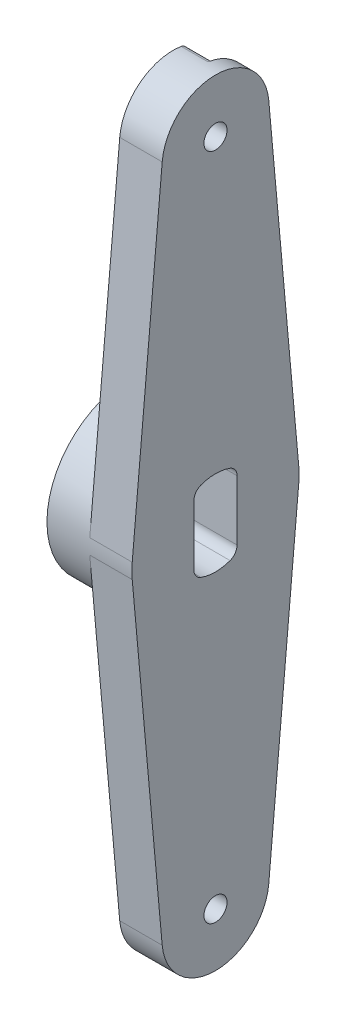
ISO-10303-21;
HEADER;
FILE_DESCRIPTION(('STEP AP214'),'2;1');
FILE_NAME('part.step','',(''),(''),'','','');
FILE_SCHEMA(('AUTOMOTIVE_DESIGN { 1 0 10303 214 1 1 1 1 }'));
ENDSEC;
DATA;
#1=APPLICATION_CONTEXT('core data for automotive mechanical design processes');
#2=APPLICATION_PROTOCOL_DEFINITION('international standard','automotive_design',2000,#1);
#3=PRODUCT_CONTEXT('',#1,'mechanical');
#4=PRODUCT('Part','Part','',(#3));
#5=PRODUCT_RELATED_PRODUCT_CATEGORY('part','',(#4));
#6=PRODUCT_DEFINITION_FORMATION('','',#4);
#7=PRODUCT_DEFINITION_CONTEXT('part definition',#1,'design');
#8=PRODUCT_DEFINITION('design','',#6,#7);
#9=PRODUCT_DEFINITION_SHAPE('','',#8);
#10=(LENGTH_UNIT() NAMED_UNIT(*) SI_UNIT(.MILLI.,.METRE.));
#11=(NAMED_UNIT(*) PLANE_ANGLE_UNIT() SI_UNIT($,.RADIAN.));
#12=(NAMED_UNIT(*) SI_UNIT($,.STERADIAN.) SOLID_ANGLE_UNIT());
#13=UNCERTAINTY_MEASURE_WITH_UNIT(LENGTH_MEASURE(1.E-05),#10,'distance_accuracy_value','');
#14=(GEOMETRIC_REPRESENTATION_CONTEXT(3) GLOBAL_UNCERTAINTY_ASSIGNED_CONTEXT((#13)) GLOBAL_UNIT_ASSIGNED_CONTEXT((#10,
#11,#12)) REPRESENTATION_CONTEXT('',''));
#15=CARTESIAN_POINT('',(0.,0.,0.));
#16=DIRECTION('',(0.,0.,1.));
#17=DIRECTION('',(1.,0.,0.));
#18=AXIS2_PLACEMENT_3D('',#15,#16,#17);
#19=CARTESIAN_POINT('',(-2.35,-50.,0.));
#20=DIRECTION('',(-1.,0.,0.));
#21=DIRECTION('',(0.,0.,1.));
#22=AXIS2_PLACEMENT_3D('',#19,#20,#21);
#23=CYLINDRICAL_SURFACE('',#22,3.5);
#24=CARTESIAN_POINT('',(-2.35,-50.,0.));
#25=DIRECTION('',(1.,0.,0.));
#26=DIRECTION('',(0.,0.,1.));
#27=AXIS2_PLACEMENT_3D('',#24,#25,#26);
#28=CIRCLE('',#27,3.5);
#29=CARTESIAN_POINT('',(-2.35,-50.,3.5));
#30=VERTEX_POINT('',#29);
#31=EDGE_CURVE('E361',#30,#30,#28,.T.);
#32=ORIENTED_EDGE('',*,*,#31,.F.);
#33=EDGE_LOOP('',(#32));
#34=FACE_BOUND('',#33,.T.);
#35=CARTESIAN_POINT('',(-4.15,-50.,0.));
#36=DIRECTION('',(1.,0.,0.));
#37=DIRECTION('',(0.,0.,1.));
#38=AXIS2_PLACEMENT_3D('',#35,#36,#37);
#39=CIRCLE('',#38,3.5);
#40=CARTESIAN_POINT('',(-4.15,-50.,3.5));
#41=VERTEX_POINT('',#40);
#42=EDGE_CURVE('E332',#41,#41,#39,.T.);
#43=ORIENTED_EDGE('',*,*,#42,.T.);
#44=EDGE_LOOP('',(#43));
#45=FACE_BOUND('',#44,.T.);
#46=ADVANCED_FACE('F34',(#34,#45),#23,.T.);
#47=CARTESIAN_POINT('',(-2.35,50.,0.));
#48=DIRECTION('',(-1.,0.,0.));
#49=DIRECTION('',(0.,0.,1.));
#50=AXIS2_PLACEMENT_3D('',#47,#48,#49);
#51=CYLINDRICAL_SURFACE('',#50,3.5);
#52=CARTESIAN_POINT('',(-2.35,50.,0.));
#53=DIRECTION('',(-1.,0.,0.));
#54=DIRECTION('',(0.,0.,1.));
#55=AXIS2_PLACEMENT_3D('',#52,#53,#54);
#56=CIRCLE('',#55,3.5);
#57=CARTESIAN_POINT('',(-2.35,50.,3.5));
#58=VERTEX_POINT('',#57);
#59=EDGE_CURVE('E521',#58,#58,#56,.T.);
#60=ORIENTED_EDGE('',*,*,#59,.T.);
#61=EDGE_LOOP('',(#60));
#62=FACE_BOUND('',#61,.T.);
#63=CARTESIAN_POINT('',(-4.15,50.,0.));
#64=DIRECTION('',(-1.,0.,0.));
#65=DIRECTION('',(0.,0.,1.));
#66=AXIS2_PLACEMENT_3D('',#63,#64,#65);
#67=CIRCLE('',#66,3.5);
#68=CARTESIAN_POINT('',(-4.15,50.,3.5));
#69=VERTEX_POINT('',#68);
#70=EDGE_CURVE('E336',#69,#69,#67,.T.);
#71=ORIENTED_EDGE('',*,*,#70,.F.);
#72=EDGE_LOOP('',(#71));
#73=FACE_BOUND('',#72,.T.);
#74=ADVANCED_FACE('F552',(#62,#73),#51,.T.);
#75=CARTESIAN_POINT('',(-6.35,0.,0.));
#76=DIRECTION('',(1.,0.,0.));
#77=DIRECTION('',(0.,0.,-1.));
#78=AXIS2_PLACEMENT_3D('',#75,#76,#77);
#79=PLANE('',#78);
#80=CARTESIAN_POINT('',(-6.35,0.,0.));
#81=DIRECTION('',(-1.,0.,0.));
#82=DIRECTION('',(0.,0.,1.));
#83=AXIS2_PLACEMENT_3D('',#80,#81,#82);
#84=CIRCLE('',#83,12.5);
#85=CARTESIAN_POINT('',(-6.35,1.125,12.4492720670728));
#86=VERTEX_POINT('',#85);
#87=CARTESIAN_POINT('',(-6.35,1.125,-12.4492720670728));
#88=VERTEX_POINT('',#87);
#89=EDGE_CURVE('E221',#86,#88,#84,.T.);
#90=ORIENTED_EDGE('',*,*,#89,.F.);
#91=DIRECTION('',(0.,-0.995941765365827,0.09));
#92=VECTOR('',#91,1.);
#93=CARTESIAN_POINT('',(-6.35,1.125,12.4492720670728));
#94=LINE('',#93,#92);
#95=CARTESIAN_POINT('',(-6.35,50.72,7.96753412292662));
#96=VERTEX_POINT('',#95);
#97=EDGE_CURVE('E226',#96,#86,#94,.T.);
#98=ORIENTED_EDGE('',*,*,#97,.F.);
#99=CARTESIAN_POINT('',(-6.35,50.,0.));
#100=DIRECTION('',(1.,0.,0.));
#101=DIRECTION('',(0.,0.,-1.));
#102=AXIS2_PLACEMENT_3D('',#99,#100,#101);
#103=CIRCLE('',#102,8.);
#104=CARTESIAN_POINT('',(-6.35,57.9065625554529,-1.21912614470803));
#105=VERTEX_POINT('',#104);
#106=EDGE_CURVE('E249',#105,#96,#103,.T.);
#107=ORIENTED_EDGE('',*,*,#106,.F.);
#108=CARTESIAN_POINT('',(-6.35,56.9182422360213,-1.06673537661953));
#109=DIRECTION('',(1.,0.,0.));
#110=DIRECTION('',(0.,0.,-1.));
#111=AXIS2_PLACEMENT_3D('',#108,#109,#110);
#112=CIRCLE('',#111,1.);
#113=CARTESIAN_POINT('',(-6.35,55.9671857197261,-1.37575237099447));
#114=VERTEX_POINT('',#113);
#115=EDGE_CURVE('E391',#105,#114,#112,.F.);
#116=ORIENTED_EDGE('',*,*,#115,.T.);
#117=DIRECTION('',(0.,0.309016994374941,-0.951056516295156));
#118=VECTOR('',#117,1.);
#119=CARTESIAN_POINT('',(-6.35,56.8583808987666,-4.11856910193741));
#120=LINE('',#119,#118);
#121=CARTESIAN_POINT('',(-6.35,54.9930467105496,1.62233922046844));
#122=VERTEX_POINT('',#121);
#123=EDGE_CURVE('E425',#122,#114,#120,.T.);
#124=ORIENTED_EDGE('',*,*,#123,.F.);
#125=CARTESIAN_POINT('',(-6.35,50.,0.));
#126=DIRECTION('',(-1.,0.,0.));
#127=DIRECTION('',(0.,0.,1.));
#128=AXIS2_PLACEMENT_3D('',#125,#126,#127);
#129=CIRCLE('',#128,5.25);
#130=CARTESIAN_POINT('',(-6.35,45.0069532894504,1.62233922046844));
#131=VERTEX_POINT('',#130);
#132=EDGE_CURVE('E430',#131,#122,#129,.T.);
#133=ORIENTED_EDGE('',*,*,#132,.F.);
#134=DIRECTION('',(0.,0.309016994374941,0.951056516295156));
#135=VECTOR('',#134,1.);
#136=CARTESIAN_POINT('',(-6.35,41.6239365758729,-8.789515624898));
#137=LINE('',#136,#135);
#138=CARTESIAN_POINT('',(-6.35,41.8278365801193,-8.16197593859896));
#139=VERTEX_POINT('',#138);
#140=EDGE_CURVE('E434',#139,#131,#137,.T.);
#141=ORIENTED_EDGE('',*,*,#140,.F.);
#142=CARTESIAN_POINT('',(-6.35,40.8767800638241,-7.85295894422402));
#143=DIRECTION('',(1.,0.,0.));
#144=DIRECTION('',(0.,0.,-1.));
#145=AXIS2_PLACEMENT_3D('',#142,#143,#144);
#146=CIRCLE('',#145,1.);
#147=CARTESIAN_POINT('',(-6.35,40.9667800638241,-8.84890070958985));
#148=VERTEX_POINT('',#147);
#149=EDGE_CURVE('E393',#139,#148,#146,.F.);
#150=ORIENTED_EDGE('',*,*,#149,.T.);
#151=DIRECTION('',(0.,0.995941765365827,0.09));
#152=VECTOR('',#151,1.);
#153=CARTESIAN_POINT('',(-6.35,1.125,-12.4492720670728));
#154=LINE('',#153,#152);
#155=EDGE_CURVE('E228',#88,#148,#154,.T.);
#156=ORIENTED_EDGE('',*,*,#155,.F.);
#157=EDGE_LOOP('',(#90,#98,#107,#116,#124,#133,#141,#150,#156));
#158=FACE_BOUND('',#157,.T.);
#159=ADVANCED_FACE('F223',(#158),#79,.F.);
#160=DIRECTION('',(0.,0.995941765365827,-0.09));
#161=VECTOR('',#160,1.);
#162=CARTESIAN_POINT('',(-6.35,-1.125,-12.4492720670728));
#163=LINE('',#162,#161);
#164=CARTESIAN_POINT('',(-6.35,-40.9667800638241,-8.84890070958985));
#165=VERTEX_POINT('',#164);
#166=CARTESIAN_POINT('',(-6.35,-1.125,-12.4492720670728));
#167=VERTEX_POINT('',#166);
#168=EDGE_CURVE('E263',#165,#167,#163,.T.);
#169=ORIENTED_EDGE('',*,*,#168,.F.);
#170=CARTESIAN_POINT('',(-6.35,-40.8767800638241,-7.85295894422402));
#171=DIRECTION('',(1.,0.,0.));
#172=DIRECTION('',(0.,0.,-1.));
#173=AXIS2_PLACEMENT_3D('',#170,#171,#172);
#174=CIRCLE('',#173,1.);
#175=CARTESIAN_POINT('',(-6.35,-41.8278365801193,-8.16197593859896));
#176=VERTEX_POINT('',#175);
#177=EDGE_CURVE('E284',#165,#176,#174,.F.);
#178=ORIENTED_EDGE('',*,*,#177,.T.);
#179=DIRECTION('',(0.,-0.309016994374941,0.951056516295156));
#180=VECTOR('',#179,1.);
#181=CARTESIAN_POINT('',(-6.35,-41.6239365758729,-8.789515624898));
#182=LINE('',#181,#180);
#183=CARTESIAN_POINT('',(-6.35,-45.0069532894504,1.62233922046844));
#184=VERTEX_POINT('',#183);
#185=EDGE_CURVE('E507',#176,#184,#182,.T.);
#186=ORIENTED_EDGE('',*,*,#185,.T.);
#187=CARTESIAN_POINT('',(-6.35,-50.,0.));
#188=DIRECTION('',(1.,0.,0.));
#189=DIRECTION('',(0.,0.,1.));
#190=AXIS2_PLACEMENT_3D('',#187,#188,#189);
#191=CIRCLE('',#190,5.25);
#192=CARTESIAN_POINT('',(-6.35,-54.9930467105496,1.62233922046844));
#193=VERTEX_POINT('',#192);
#194=EDGE_CURVE('E514',#184,#193,#191,.T.);
#195=ORIENTED_EDGE('',*,*,#194,.T.);
#196=DIRECTION('',(0.,-0.309016994374941,-0.951056516295156));
#197=VECTOR('',#196,1.);
#198=CARTESIAN_POINT('',(-6.35,-56.8583808987666,-4.11856910193741));
#199=LINE('',#198,#197);
#200=CARTESIAN_POINT('',(-6.35,-55.9671857197261,-1.37575237099447));
#201=VERTEX_POINT('',#200);
#202=EDGE_CURVE('E512',#193,#201,#199,.T.);
#203=ORIENTED_EDGE('',*,*,#202,.T.);
#204=CARTESIAN_POINT('',(-6.35,-56.9182422360213,-1.06673537661953));
#205=DIRECTION('',(1.,0.,0.));
#206=DIRECTION('',(0.,0.,-1.));
#207=AXIS2_PLACEMENT_3D('',#204,#205,#206);
#208=CIRCLE('',#207,1.);
#209=CARTESIAN_POINT('',(-6.35,-57.9065625554529,-1.21912614470803));
#210=VERTEX_POINT('',#209);
#211=EDGE_CURVE('E281',#201,#210,#208,.F.);
#212=ORIENTED_EDGE('',*,*,#211,.T.);
#213=CARTESIAN_POINT('',(-6.35,-50.,0.));
#214=DIRECTION('',(1.,0.,0.));
#215=DIRECTION('',(0.,0.,-1.));
#216=AXIS2_PLACEMENT_3D('',#213,#214,#215);
#217=CIRCLE('',#216,8.);
#218=CARTESIAN_POINT('',(-6.35,-50.72,7.96753412292662));
#219=VERTEX_POINT('',#218);
#220=EDGE_CURVE('E252',#219,#210,#217,.T.);
#221=ORIENTED_EDGE('',*,*,#220,.F.);
#222=DIRECTION('',(0.,-0.995941765365827,-0.09));
#223=VECTOR('',#222,1.);
#224=CARTESIAN_POINT('',(-6.35,-1.125,12.4492720670728));
#225=LINE('',#224,#223);
#226=CARTESIAN_POINT('',(-6.35,-1.125,12.4492720670728));
#227=VERTEX_POINT('',#226);
#228=EDGE_CURVE('E248',#227,#219,#225,.T.);
#229=ORIENTED_EDGE('',*,*,#228,.F.);
#230=EDGE_CURVE('E282',#167,#227,#84,.T.);
#231=ORIENTED_EDGE('',*,*,#230,.F.);
#232=EDGE_LOOP('',(#169,#178,#186,#195,#203,#212,#221,#229,#231));
#233=FACE_BOUND('',#232,.T.);
#234=ADVANCED_FACE('F480',(#233),#79,.F.);
#235=CARTESIAN_POINT('',(-6.35,-1.125,-12.4492720670728));
#236=DIRECTION('',(0.,-0.09,-0.995941765365827));
#237=DIRECTION('',(0.,0.995941765365827,-0.09));
#238=AXIS2_PLACEMENT_3D('',#235,#236,#237);
#239=PLANE('',#238);
#240=DIRECTION('',(0.,0.995941765365827,-0.0899999999999998));
#241=VECTOR('',#240,1.);
#242=CARTESIAN_POINT('',(-2.35,-41.6239365758729,-8.789515624898));
#243=LINE('',#242,#241);
#244=CARTESIAN_POINT('',(-2.35,-50.72,-7.96753412292662));
#245=VERTEX_POINT('',#244);
#246=CARTESIAN_POINT('',(-2.35,-40.9667800638241,-8.84890070958984));
#247=VERTEX_POINT('',#246);
#248=EDGE_CURVE('E510',#245,#247,#243,.T.);
#249=ORIENTED_EDGE('',*,*,#248,.T.);
#250=DIRECTION('',(-1.,0.,0.));
#251=VECTOR('',#250,1.);
#252=CARTESIAN_POINT('',(-6.35,-40.9667800638241,-8.84890070958985));
#253=LINE('',#252,#251);
#254=EDGE_CURVE('E278',#247,#165,#253,.T.);
#255=ORIENTED_EDGE('',*,*,#254,.T.);
#256=ORIENTED_EDGE('',*,*,#168,.T.);
#257=DIRECTION('',(1.,0.,0.));
#258=VECTOR('',#257,1.);
#259=CARTESIAN_POINT('',(-6.35,-1.125,-12.4492720670728));
#260=LINE('',#259,#258);
#261=CARTESIAN_POINT('',(0.,-1.125,-12.4492720670728));
#262=VERTEX_POINT('',#261);
#263=EDGE_CURVE('E272',#167,#262,#260,.T.);
#264=ORIENTED_EDGE('',*,*,#263,.T.);
#265=DIRECTION('',(0.,0.995941765365827,-0.09));
#266=VECTOR('',#265,1.);
#267=CARTESIAN_POINT('',(0.,-1.125,-12.4492720670728));
#268=LINE('',#267,#266);
#269=CARTESIAN_POINT('',(0.,-50.72,-7.96753412292662));
#270=VERTEX_POINT('',#269);
#271=EDGE_CURVE('E267',#270,#262,#268,.T.);
#272=ORIENTED_EDGE('',*,*,#271,.F.);
#273=DIRECTION('',(1.,0.,0.));
#274=VECTOR('',#273,1.);
#275=CARTESIAN_POINT('',(-6.35,-50.72,-7.96753412292662));
#276=LINE('',#275,#274);
#277=EDGE_CURVE('E379',#245,#270,#276,.T.);
#278=ORIENTED_EDGE('',*,*,#277,.F.);
#279=EDGE_LOOP('',(#249,#255,#256,#264,#272,#278));
#280=FACE_BOUND('',#279,.T.);
#281=ADVANCED_FACE('F468',(#280),#239,.T.);
#282=CARTESIAN_POINT('',(-6.35,-50.,0.));
#283=DIRECTION('',(1.,0.,0.));
#284=DIRECTION('',(0.,0.,-1.));
#285=AXIS2_PLACEMENT_3D('',#282,#283,#284);
#286=CYLINDRICAL_SURFACE('',#285,8.);
#287=ORIENTED_EDGE('',*,*,#220,.T.);
#288=DIRECTION('',(1.,0.,0.));
#289=VECTOR('',#288,1.);
#290=CARTESIAN_POINT('',(-6.35,-57.9065625554529,-1.21912614470803));
#291=LINE('',#290,#289);
#292=CARTESIAN_POINT('',(-2.35,-57.9065625554529,-1.21912614470803));
#293=VERTEX_POINT('',#292);
#294=EDGE_CURVE('E291',#210,#293,#291,.T.);
#295=ORIENTED_EDGE('',*,*,#294,.T.);
#296=CARTESIAN_POINT('',(-2.35,-50.,0.));
#297=DIRECTION('',(1.,0.,0.));
#298=DIRECTION('',(0.,0.,1.));
#299=AXIS2_PLACEMENT_3D('',#296,#297,#298);
#300=CIRCLE('',#299,8.);
#301=EDGE_CURVE('E497',#293,#245,#300,.T.);
#302=ORIENTED_EDGE('',*,*,#301,.T.);
#303=ORIENTED_EDGE('',*,*,#277,.T.);
#304=CARTESIAN_POINT('',(0.,-50.,0.));
#305=DIRECTION('',(1.,0.,0.));
#306=DIRECTION('',(0.,0.,-1.));
#307=AXIS2_PLACEMENT_3D('',#304,#305,#306);
#308=CIRCLE('',#307,8.);
#309=CARTESIAN_POINT('',(0.,-50.72,7.96753412292662));
#310=VERTEX_POINT('',#309);
#311=EDGE_CURVE('E459',#310,#270,#308,.T.);
#312=ORIENTED_EDGE('',*,*,#311,.F.);
#313=DIRECTION('',(1.,0.,0.));
#314=VECTOR('',#313,1.);
#315=CARTESIAN_POINT('',(-6.35,-50.72,7.96753412292662));
#316=LINE('',#315,#314);
#317=EDGE_CURVE('E373',#219,#310,#316,.T.);
#318=ORIENTED_EDGE('',*,*,#317,.F.);
#319=EDGE_LOOP('',(#287,#295,#302,#303,#312,#318));
#320=FACE_BOUND('',#319,.T.);
#321=ADVANCED_FACE('F484',(#320),#286,.T.);
#322=CARTESIAN_POINT('',(-6.35,-1.125,12.4492720670728));
#323=DIRECTION('',(0.,-0.09,0.995941765365827));
#324=DIRECTION('',(0.,-0.995941765365827,-0.09));
#325=AXIS2_PLACEMENT_3D('',#322,#323,#324);
#326=PLANE('',#325);
#327=DIRECTION('',(0.,-0.995941765365827,-0.09));
#328=VECTOR('',#327,1.);
#329=CARTESIAN_POINT('',(0.,-1.125,12.4492720670728));
#330=LINE('',#329,#328);
#331=CARTESIAN_POINT('',(0.,-1.125,12.4492720670728));
#332=VERTEX_POINT('',#331);
#333=EDGE_CURVE('E456',#332,#310,#330,.T.);
#334=ORIENTED_EDGE('',*,*,#333,.F.);
#335=DIRECTION('',(1.,0.,0.));
#336=VECTOR('',#335,1.);
#337=CARTESIAN_POINT('',(-6.35,-1.125,12.4492720670728));
#338=LINE('',#337,#336);
#339=EDGE_CURVE('E243',#227,#332,#338,.T.);
#340=ORIENTED_EDGE('',*,*,#339,.F.);
#341=ORIENTED_EDGE('',*,*,#228,.T.);
#342=ORIENTED_EDGE('',*,*,#317,.T.);
#343=EDGE_LOOP('',(#334,#340,#341,#342));
#344=FACE_BOUND('',#343,.T.);
#345=ADVANCED_FACE('F476',(#344),#326,.T.);
#346=CARTESIAN_POINT('',(-6.35,0.,0.));
#347=DIRECTION('',(1.,0.,0.));
#348=DIRECTION('',(0.,0.,-1.));
#349=AXIS2_PLACEMENT_3D('',#346,#347,#348);
#350=CYLINDRICAL_SURFACE('',#349,12.5);
#351=CARTESIAN_POINT('',(0.,0.,0.));
#352=DIRECTION('',(1.,0.,0.));
#353=DIRECTION('',(0.,0.,-1.));
#354=AXIS2_PLACEMENT_3D('',#351,#352,#353);
#355=CIRCLE('',#354,12.5);
#356=CARTESIAN_POINT('',(0.,1.125,12.4492720670728));
#357=VERTEX_POINT('',#356);
#358=EDGE_CURVE('E239',#357,#332,#355,.T.);
#359=ORIENTED_EDGE('',*,*,#358,.F.);
#360=DIRECTION('',(1.,0.,0.));
#361=VECTOR('',#360,1.);
#362=CARTESIAN_POINT('',(-6.35,1.125,12.4492720670728));
#363=LINE('',#362,#361);
#364=EDGE_CURVE('E235',#86,#357,#363,.T.);
#365=ORIENTED_EDGE('',*,*,#364,.F.);
#366=ORIENTED_EDGE('',*,*,#89,.T.);
#367=DIRECTION('',(1.,0.,0.));
#368=VECTOR('',#367,1.);
#369=CARTESIAN_POINT('',(-6.35,1.125,-12.4492720670728));
#370=LINE('',#369,#368);
#371=CARTESIAN_POINT('',(0.,1.125,-12.4492720670728));
#372=VERTEX_POINT('',#371);
#373=EDGE_CURVE('E260',#88,#372,#370,.T.);
#374=ORIENTED_EDGE('',*,*,#373,.T.);
#375=CARTESIAN_POINT('',(0.,0.,0.));
#376=DIRECTION('',(1.,0.,0.));
#377=DIRECTION('',(0.,0.,-1.));
#378=AXIS2_PLACEMENT_3D('',#375,#376,#377);
#379=CIRCLE('',#378,12.5);
#380=EDGE_CURVE('E439',#262,#372,#379,.T.);
#381=ORIENTED_EDGE('',*,*,#380,.F.);
#382=ORIENTED_EDGE('',*,*,#263,.F.);
#383=ORIENTED_EDGE('',*,*,#230,.T.);
#384=ORIENTED_EDGE('',*,*,#339,.T.);
#385=EDGE_LOOP('',(#359,#365,#366,#374,#381,#382,#383,#384));
#386=FACE_BOUND('',#385,.T.);
#387=CARTESIAN_POINT('',(-12.7,0.,0.));
#388=DIRECTION('',(-1.,0.,0.));
#389=DIRECTION('',(0.,0.,1.));
#390=AXIS2_PLACEMENT_3D('',#387,#388,#389);
#391=CIRCLE('',#390,12.5);
#392=CARTESIAN_POINT('',(-12.7,0.,12.5));
#393=VERTEX_POINT('',#392);
#394=EDGE_CURVE('E231',#393,#393,#391,.T.);
#395=ORIENTED_EDGE('',*,*,#394,.F.);
#396=EDGE_LOOP('',(#395));
#397=FACE_BOUND('',#396,.T.);
#398=ADVANCED_FACE('F236',(#386,#397),#350,.T.);
#399=CARTESIAN_POINT('',(-6.35,1.125,12.4492720670728));
#400=DIRECTION('',(0.,0.09,0.995941765365827));
#401=DIRECTION('',(0.,-0.995941765365827,0.09));
#402=AXIS2_PLACEMENT_3D('',#399,#400,#401);
#403=PLANE('',#402);
#404=DIRECTION('',(0.,-0.995941765365827,0.09));
#405=VECTOR('',#404,1.);
#406=CARTESIAN_POINT('',(0.,1.125,12.4492720670728));
#407=LINE('',#406,#405);
#408=CARTESIAN_POINT('',(0.,50.72,7.96753412292662));
#409=VERTEX_POINT('',#408);
#410=EDGE_CURVE('E453',#409,#357,#407,.T.);
#411=ORIENTED_EDGE('',*,*,#410,.F.);
#412=DIRECTION('',(1.,0.,0.));
#413=VECTOR('',#412,1.);
#414=CARTESIAN_POINT('',(-6.35,50.72,7.96753412292662));
#415=LINE('',#414,#413);
#416=EDGE_CURVE('E244',#96,#409,#415,.T.);
#417=ORIENTED_EDGE('',*,*,#416,.F.);
#418=ORIENTED_EDGE('',*,*,#97,.T.);
#419=ORIENTED_EDGE('',*,*,#364,.T.);
#420=EDGE_LOOP('',(#411,#417,#418,#419));
#421=FACE_BOUND('',#420,.T.);
#422=ADVANCED_FACE('F247',(#421),#403,.T.);
#423=CARTESIAN_POINT('',(-6.35,50.,0.));
#424=DIRECTION('',(1.,0.,0.));
#425=DIRECTION('',(0.,0.,-1.));
#426=AXIS2_PLACEMENT_3D('',#423,#424,#425);
#427=CYLINDRICAL_SURFACE('',#426,8.);
#428=CARTESIAN_POINT('',(-2.35,50.,0.));
#429=DIRECTION('',(-1.,0.,0.));
#430=DIRECTION('',(0.,0.,1.));
#431=AXIS2_PLACEMENT_3D('',#428,#429,#430);
#432=CIRCLE('',#431,8.);
#433=CARTESIAN_POINT('',(-2.35,57.9065625554529,-1.21912614470803));
#434=VERTEX_POINT('',#433);
#435=CARTESIAN_POINT('',(-2.35,50.72,-7.96753412292662));
#436=VERTEX_POINT('',#435);
#437=EDGE_CURVE('E411',#434,#436,#432,.T.);
#438=ORIENTED_EDGE('',*,*,#437,.F.);
#439=DIRECTION('',(1.,0.,0.));
#440=VECTOR('',#439,1.);
#441=CARTESIAN_POINT('',(-6.35,57.9065625554529,-1.21912614470803));
#442=LINE('',#441,#440);
#443=EDGE_CURVE('E398',#434,#105,#442,.F.);
#444=ORIENTED_EDGE('',*,*,#443,.T.);
#445=ORIENTED_EDGE('',*,*,#106,.T.);
#446=ORIENTED_EDGE('',*,*,#416,.T.);
#447=CARTESIAN_POINT('',(0.,50.,0.));
#448=DIRECTION('',(1.,0.,0.));
#449=DIRECTION('',(0.,0.,-1.));
#450=AXIS2_PLACEMENT_3D('',#447,#448,#449);
#451=CIRCLE('',#450,8.);
#452=CARTESIAN_POINT('',(0.,50.72,-7.96753412292662));
#453=VERTEX_POINT('',#452);
#454=EDGE_CURVE('E450',#453,#409,#451,.T.);
#455=ORIENTED_EDGE('',*,*,#454,.F.);
#456=DIRECTION('',(1.,0.,0.));
#457=VECTOR('',#456,1.);
#458=CARTESIAN_POINT('',(-6.35,50.72,-7.96753412292662));
#459=LINE('',#458,#457);
#460=EDGE_CURVE('E262',#436,#453,#459,.T.);
#461=ORIENTED_EDGE('',*,*,#460,.F.);
#462=EDGE_LOOP('',(#438,#444,#445,#446,#455,#461));
#463=FACE_BOUND('',#462,.T.);
#464=ADVANCED_FACE('F420',(#463),#427,.T.);
#465=CARTESIAN_POINT('',(-6.35,1.125,-12.4492720670728));
#466=DIRECTION('',(0.,0.09,-0.995941765365827));
#467=DIRECTION('',(0.,0.995941765365827,0.09));
#468=AXIS2_PLACEMENT_3D('',#465,#466,#467);
#469=PLANE('',#468);
#470=ORIENTED_EDGE('',*,*,#155,.T.);
#471=DIRECTION('',(-1.,0.,0.));
#472=VECTOR('',#471,1.);
#473=CARTESIAN_POINT('',(-2.35,40.9667800638241,-8.84890070958985));
#474=LINE('',#473,#472);
#475=CARTESIAN_POINT('',(-2.35,40.9667800638241,-8.84890070958984));
#476=VERTEX_POINT('',#475);
#477=EDGE_CURVE('E395',#148,#476,#474,.F.);
#478=ORIENTED_EDGE('',*,*,#477,.T.);
#479=DIRECTION('',(0.,-0.995941765365827,-0.0899999999999998));
#480=VECTOR('',#479,1.);
#481=CARTESIAN_POINT('',(-2.35,41.6239365758729,-8.789515624898));
#482=LINE('',#481,#480);
#483=EDGE_CURVE('E432',#436,#476,#482,.T.);
#484=ORIENTED_EDGE('',*,*,#483,.F.);
#485=ORIENTED_EDGE('',*,*,#460,.T.);
#486=DIRECTION('',(0.,0.995941765365827,0.09));
#487=VECTOR('',#486,1.);
#488=CARTESIAN_POINT('',(0.,1.125,-12.4492720670728));
#489=LINE('',#488,#487);
#490=EDGE_CURVE('E447',#372,#453,#489,.T.);
#491=ORIENTED_EDGE('',*,*,#490,.F.);
#492=ORIENTED_EDGE('',*,*,#373,.F.);
#493=EDGE_LOOP('',(#470,#478,#484,#485,#491,#492));
#494=FACE_BOUND('',#493,.T.);
#495=ADVANCED_FACE('F474',(#494),#469,.T.);
#496=CARTESIAN_POINT('',(0.,0.,0.));
#497=DIRECTION('',(1.,0.,0.));
#498=DIRECTION('',(0.,0.,-1.));
#499=AXIS2_PLACEMENT_3D('',#496,#497,#498);
#500=PLANE('',#499);
#501=CARTESIAN_POINT('',(0.,-50.,0.));
#502=DIRECTION('',(1.,0.,0.));
#503=DIRECTION('',(0.,0.,-1.));
#504=AXIS2_PLACEMENT_3D('',#501,#502,#503);
#505=CIRCLE('',#504,1.7272);
#506=CARTESIAN_POINT('',(0.,-50.,-1.7272));
#507=VERTEX_POINT('',#506);
#508=EDGE_CURVE('E339',#507,#507,#505,.T.);
#509=ORIENTED_EDGE('',*,*,#508,.F.);
#510=EDGE_LOOP('',(#509));
#511=FACE_BOUND('',#510,.T.);
#512=CARTESIAN_POINT('',(0.,50.,0.));
#513=DIRECTION('',(1.,0.,0.));
#514=DIRECTION('',(0.,0.,-1.));
#515=AXIS2_PLACEMENT_3D('',#512,#513,#514);
#516=CIRCLE('',#515,1.7272);
#517=CARTESIAN_POINT('',(0.,50.,-1.7272));
#518=VERTEX_POINT('',#517);
#519=EDGE_CURVE('E331',#518,#518,#516,.T.);
#520=ORIENTED_EDGE('',*,*,#519,.F.);
#521=EDGE_LOOP('',(#520));
#522=FACE_BOUND('',#521,.T.);
#523=DIRECTION('',(0.,1.,0.));
#524=VECTOR('',#523,1.);
#525=CARTESIAN_POINT('',(0.,0.,3.22580000000001));
#526=LINE('',#525,#524);
#527=CARTESIAN_POINT('',(0.,-4.485365999559,3.22580000000001));
#528=VERTEX_POINT('',#527);
#529=CARTESIAN_POINT('',(0.,4.485365999559,3.22580000000001));
#530=VERTEX_POINT('',#529);
#531=EDGE_CURVE('E888',#528,#530,#526,.T.);
#532=ORIENTED_EDGE('',*,*,#531,.T.);
#533=CARTESIAN_POINT('',(0.,4.485365999559,1.63830000000001));
#534=DIRECTION('',(1.,0.,0.));
#535=DIRECTION('',(0.,0.,-1.));
#536=AXIS2_PLACEMENT_3D('',#533,#534,#535);
#537=CIRCLE('',#536,1.5875);
#538=CARTESIAN_POINT('',(0.,5.97651161111453,2.182947606383));
#539=VERTEX_POINT('',#538);
#540=EDGE_CURVE('E327',#530,#539,#537,.F.);
#541=ORIENTED_EDGE('',*,*,#540,.T.);
#542=CARTESIAN_POINT('',(0.,0.,0.));
#543=DIRECTION('',(-1.,0.,0.));
#544=DIRECTION('',(0.,0.,1.));
#545=AXIS2_PLACEMENT_3D('',#542,#543,#544);
#546=CIRCLE('',#545,6.3627);
#547=CARTESIAN_POINT('',(0.,5.97651161111453,-2.182947606383));
#548=VERTEX_POINT('',#547);
#549=EDGE_CURVE('E232',#539,#548,#546,.T.);
#550=ORIENTED_EDGE('',*,*,#549,.T.);
#551=CARTESIAN_POINT('',(0.,4.485365999559,-1.63830000000001));
#552=DIRECTION('',(1.,0.,0.));
#553=DIRECTION('',(0.,0.,-1.));
#554=AXIS2_PLACEMENT_3D('',#551,#552,#553);
#555=CIRCLE('',#554,1.5875);
#556=CARTESIAN_POINT('',(0.,4.485365999559,-3.22580000000001));
#557=VERTEX_POINT('',#556);
#558=EDGE_CURVE('E11',#548,#557,#555,.F.);
#559=ORIENTED_EDGE('',*,*,#558,.T.);
#560=DIRECTION('',(0.,1.,0.));
#561=VECTOR('',#560,1.);
#562=CARTESIAN_POINT('',(0.,0.,-3.22580000000001));
#563=LINE('',#562,#561);
#564=CARTESIAN_POINT('',(0.,-4.485365999559,-3.22580000000001));
#565=VERTEX_POINT('',#564);
#566=EDGE_CURVE('E359',#557,#565,#563,.F.);
#567=ORIENTED_EDGE('',*,*,#566,.T.);
#568=CARTESIAN_POINT('',(0.,-4.485365999559,-1.63830000000001));
#569=DIRECTION('',(1.,0.,0.));
#570=DIRECTION('',(0.,0.,-1.));
#571=AXIS2_PLACEMENT_3D('',#568,#569,#570);
#572=CIRCLE('',#571,1.5875);
#573=CARTESIAN_POINT('',(0.,-5.97651161111453,-2.182947606383));
#574=VERTEX_POINT('',#573);
#575=EDGE_CURVE('E320',#565,#574,#572,.F.);
#576=ORIENTED_EDGE('',*,*,#575,.T.);
#577=CARTESIAN_POINT('',(0.,0.,0.));
#578=DIRECTION('',(-1.,0.,0.));
#579=DIRECTION('',(0.,0.,1.));
#580=AXIS2_PLACEMENT_3D('',#577,#578,#579);
#581=CIRCLE('',#580,6.3627);
#582=CARTESIAN_POINT('',(0.,-5.97651161111453,2.182947606383));
#583=VERTEX_POINT('',#582);
#584=EDGE_CURVE('E895',#574,#583,#581,.T.);
#585=ORIENTED_EDGE('',*,*,#584,.T.);
#586=CARTESIAN_POINT('',(0.,-4.485365999559,1.63830000000001));
#587=DIRECTION('',(1.,0.,0.));
#588=DIRECTION('',(0.,0.,-1.));
#589=AXIS2_PLACEMENT_3D('',#586,#587,#588);
#590=CIRCLE('',#589,1.5875);
#591=EDGE_CURVE('E324',#583,#528,#590,.F.);
#592=ORIENTED_EDGE('',*,*,#591,.T.);
#593=EDGE_LOOP('',(#532,#541,#550,#559,#567,#576,#585,#592));
#594=FACE_BOUND('',#593,.T.);
#595=ORIENTED_EDGE('',*,*,#380,.T.);
#596=ORIENTED_EDGE('',*,*,#490,.T.);
#597=ORIENTED_EDGE('',*,*,#454,.T.);
#598=ORIENTED_EDGE('',*,*,#410,.T.);
#599=ORIENTED_EDGE('',*,*,#358,.T.);
#600=ORIENTED_EDGE('',*,*,#333,.T.);
#601=ORIENTED_EDGE('',*,*,#311,.T.);
#602=ORIENTED_EDGE('',*,*,#271,.T.);
#603=EDGE_LOOP('',(#595,#596,#597,#598,#599,#600,#601,#602));
#604=FACE_BOUND('',#603,.T.);
#605=ADVANCED_FACE('F464',(#511,#522,#594,#604),#500,.T.);
#606=CARTESIAN_POINT('',(-2.35,56.8583808987666,-4.11856910193741));
#607=DIRECTION('',(0.,0.951056516295156,0.309016994374941));
#608=DIRECTION('',(0.,-0.309016994374941,0.951056516295156));
#609=AXIS2_PLACEMENT_3D('',#606,#607,#608);
#610=PLANE('',#609);
#611=ORIENTED_EDGE('',*,*,#123,.T.);
#612=DIRECTION('',(-1.,0.,0.));
#613=VECTOR('',#612,1.);
#614=CARTESIAN_POINT('',(-2.35,55.9671857197261,-1.37575237099447));
#615=LINE('',#614,#613);
#616=CARTESIAN_POINT('',(-2.35,55.9671857197261,-1.37575237099447));
#617=VERTEX_POINT('',#616);
#618=EDGE_CURVE('E401',#114,#617,#615,.F.);
#619=ORIENTED_EDGE('',*,*,#618,.T.);
#620=DIRECTION('',(0.,0.309016994374941,-0.951056516295156));
#621=VECTOR('',#620,1.);
#622=CARTESIAN_POINT('',(-2.35,56.8583808987666,-4.11856910193741));
#623=LINE('',#622,#621);
#624=CARTESIAN_POINT('',(-2.35,54.9930467105496,1.62233922046844));
#625=VERTEX_POINT('',#624);
#626=EDGE_CURVE('E415',#625,#617,#623,.T.);
#627=ORIENTED_EDGE('',*,*,#626,.F.);
#628=DIRECTION('',(-1.,0.,0.));
#629=VECTOR('',#628,1.);
#630=CARTESIAN_POINT('',(-2.35,54.9930467105496,1.62233922046844));
#631=LINE('',#630,#629);
#632=EDGE_CURVE('E428',#625,#122,#631,.T.);
#633=ORIENTED_EDGE('',*,*,#632,.T.);
#634=EDGE_LOOP('',(#611,#619,#627,#633));
#635=FACE_BOUND('',#634,.T.);
#636=ADVANCED_FACE('F427',(#635),#610,.F.);
#637=CARTESIAN_POINT('',(-2.35,50.,0.));
#638=DIRECTION('',(-1.,0.,0.));
#639=DIRECTION('',(0.,0.,1.));
#640=AXIS2_PLACEMENT_3D('',#637,#638,#639);
#641=CYLINDRICAL_SURFACE('',#640,5.25);
#642=ORIENTED_EDGE('',*,*,#132,.T.);
#643=ORIENTED_EDGE('',*,*,#632,.F.);
#644=CARTESIAN_POINT('',(-2.35,50.,0.));
#645=DIRECTION('',(-1.,0.,0.));
#646=DIRECTION('',(0.,0.,1.));
#647=AXIS2_PLACEMENT_3D('',#644,#645,#646);
#648=CIRCLE('',#647,5.25);
#649=CARTESIAN_POINT('',(-2.35,45.0069532894504,1.62233922046844));
#650=VERTEX_POINT('',#649);
#651=EDGE_CURVE('E528',#650,#625,#648,.T.);
#652=ORIENTED_EDGE('',*,*,#651,.F.);
#653=DIRECTION('',(-1.,0.,0.));
#654=VECTOR('',#653,1.);
#655=CARTESIAN_POINT('',(-2.35,45.0069532894504,1.62233922046844));
#656=LINE('',#655,#654);
#657=EDGE_CURVE('E440',#650,#131,#656,.T.);
#658=ORIENTED_EDGE('',*,*,#657,.T.);
#659=EDGE_LOOP('',(#642,#643,#652,#658));
#660=FACE_BOUND('',#659,.T.);
#661=ADVANCED_FACE('F537',(#660),#641,.F.);
#662=CARTESIAN_POINT('',(-2.35,41.6239365758729,-8.789515624898));
#663=DIRECTION('',(0.,-0.951056516295156,0.309016994374941));
#664=DIRECTION('',(0.,-0.309016994374941,-0.951056516295156));
#665=AXIS2_PLACEMENT_3D('',#662,#663,#664);
#666=PLANE('',#665);
#667=DIRECTION('',(0.,0.309016994374941,0.951056516295156));
#668=VECTOR('',#667,1.);
#669=CARTESIAN_POINT('',(-2.35,41.6239365758729,-8.789515624898));
#670=LINE('',#669,#668);
#671=CARTESIAN_POINT('',(-2.35,41.8278365801193,-8.16197593859896));
#672=VERTEX_POINT('',#671);
#673=EDGE_CURVE('E526',#672,#650,#670,.T.);
#674=ORIENTED_EDGE('',*,*,#673,.F.);
#675=DIRECTION('',(-1.,0.,0.));
#676=VECTOR('',#675,1.);
#677=CARTESIAN_POINT('',(-6.35,41.8278365801193,-8.16197593859896));
#678=LINE('',#677,#676);
#679=EDGE_CURVE('E388',#672,#139,#678,.T.);
#680=ORIENTED_EDGE('',*,*,#679,.T.);
#681=ORIENTED_EDGE('',*,*,#140,.T.);
#682=ORIENTED_EDGE('',*,*,#657,.F.);
#683=EDGE_LOOP('',(#674,#680,#681,#682));
#684=FACE_BOUND('',#683,.T.);
#685=ADVANCED_FACE('F533',(#684),#666,.F.);
#686=CARTESIAN_POINT('',(-2.35,50.,0.));
#687=DIRECTION('',(-1.,0.,0.));
#688=DIRECTION('',(0.,0.,1.));
#689=AXIS2_PLACEMENT_3D('',#686,#687,#688);
#690=PLANE('',#689);
#691=ORIENTED_EDGE('',*,*,#59,.F.);
#692=EDGE_LOOP('',(#691));
#693=FACE_BOUND('',#692,.T.);
#694=ORIENTED_EDGE('',*,*,#437,.T.);
#695=ORIENTED_EDGE('',*,*,#483,.T.);
#696=CARTESIAN_POINT('',(-2.35,40.8767800638241,-7.85295894422402));
#697=DIRECTION('',(-1.,0.,0.));
#698=DIRECTION('',(0.,0.,1.));
#699=AXIS2_PLACEMENT_3D('',#696,#697,#698);
#700=CIRCLE('',#699,1.);
#701=EDGE_CURVE('E402',#476,#672,#700,.F.);
#702=ORIENTED_EDGE('',*,*,#701,.T.);
#703=ORIENTED_EDGE('',*,*,#673,.T.);
#704=ORIENTED_EDGE('',*,*,#651,.T.);
#705=ORIENTED_EDGE('',*,*,#626,.T.);
#706=CARTESIAN_POINT('',(-2.35,56.9182422360213,-1.06673537661953));
#707=DIRECTION('',(-1.,0.,0.));
#708=DIRECTION('',(0.,0.,1.));
#709=AXIS2_PLACEMENT_3D('',#706,#707,#708);
#710=CIRCLE('',#709,1.);
#711=EDGE_CURVE('E368',#617,#434,#710,.F.);
#712=ORIENTED_EDGE('',*,*,#711,.T.);
#713=EDGE_LOOP('',(#694,#695,#702,#703,#704,#705,#712));
#714=FACE_BOUND('',#713,.T.);
#715=ADVANCED_FACE('F410',(#693,#714),#690,.T.);
#716=CARTESIAN_POINT('',(-2.35,40.8767800638241,-7.85295894422402));
#717=DIRECTION('',(1.,0.,0.));
#718=DIRECTION('',(0.,0.,-1.));
#719=AXIS2_PLACEMENT_3D('',#716,#717,#718);
#720=CYLINDRICAL_SURFACE('',#719,1.);
#721=ORIENTED_EDGE('',*,*,#701,.F.);
#722=ORIENTED_EDGE('',*,*,#477,.F.);
#723=ORIENTED_EDGE('',*,*,#149,.F.);
#724=ORIENTED_EDGE('',*,*,#679,.F.);
#725=EDGE_LOOP('',(#721,#722,#723,#724));
#726=FACE_BOUND('',#725,.T.);
#727=ADVANCED_FACE('F539',(#726),#720,.T.);
#728=CARTESIAN_POINT('',(-6.35,56.9182422360213,-1.06673537661953));
#729=DIRECTION('',(1.,0.,0.));
#730=DIRECTION('',(0.,0.,-1.));
#731=AXIS2_PLACEMENT_3D('',#728,#729,#730);
#732=CYLINDRICAL_SURFACE('',#731,1.);
#733=ORIENTED_EDGE('',*,*,#711,.F.);
#734=ORIENTED_EDGE('',*,*,#618,.F.);
#735=ORIENTED_EDGE('',*,*,#115,.F.);
#736=ORIENTED_EDGE('',*,*,#443,.F.);
#737=EDGE_LOOP('',(#733,#734,#735,#736));
#738=FACE_BOUND('',#737,.T.);
#739=ADVANCED_FACE('F418',(#738),#732,.T.);
#740=CARTESIAN_POINT('',(-2.35,-50.,0.));
#741=DIRECTION('',(-1.,0.,0.));
#742=DIRECTION('',(0.,0.,1.));
#743=AXIS2_PLACEMENT_3D('',#740,#741,#742);
#744=PLANE('',#743);
#745=ORIENTED_EDGE('',*,*,#301,.F.);
#746=CARTESIAN_POINT('',(-2.35,-56.9182422360213,-1.06673537661953));
#747=DIRECTION('',(-1.,0.,0.));
#748=DIRECTION('',(0.,0.,1.));
#749=AXIS2_PLACEMENT_3D('',#746,#747,#748);
#750=CIRCLE('',#749,1.);
#751=CARTESIAN_POINT('',(-2.35,-55.9671857197261,-1.37575237099447));
#752=VERTEX_POINT('',#751);
#753=EDGE_CURVE('E297',#293,#752,#750,.F.);
#754=ORIENTED_EDGE('',*,*,#753,.T.);
#755=DIRECTION('',(0.,-0.309016994374941,-0.951056516295156));
#756=VECTOR('',#755,1.);
#757=CARTESIAN_POINT('',(-2.35,-56.8583808987666,-4.11856910193741));
#758=LINE('',#757,#756);
#759=CARTESIAN_POINT('',(-2.35,-54.9930467105496,1.62233922046844));
#760=VERTEX_POINT('',#759);
#761=EDGE_CURVE('E496',#760,#752,#758,.T.);
#762=ORIENTED_EDGE('',*,*,#761,.F.);
#763=CARTESIAN_POINT('',(-2.35,-50.,0.));
#764=DIRECTION('',(1.,0.,0.));
#765=DIRECTION('',(0.,0.,1.));
#766=AXIS2_PLACEMENT_3D('',#763,#764,#765);
#767=CIRCLE('',#766,5.25);
#768=CARTESIAN_POINT('',(-2.35,-45.0069532894504,1.62233922046844));
#769=VERTEX_POINT('',#768);
#770=EDGE_CURVE('E503',#769,#760,#767,.T.);
#771=ORIENTED_EDGE('',*,*,#770,.F.);
#772=DIRECTION('',(0.,-0.309016994374941,0.951056516295156));
#773=VECTOR('',#772,1.);
#774=CARTESIAN_POINT('',(-2.35,-41.6239365758729,-8.789515624898));
#775=LINE('',#774,#773);
#776=CARTESIAN_POINT('',(-2.35,-41.8278365801193,-8.16197593859896));
#777=VERTEX_POINT('',#776);
#778=EDGE_CURVE('E505',#777,#769,#775,.T.);
#779=ORIENTED_EDGE('',*,*,#778,.F.);
#780=CARTESIAN_POINT('',(-2.35,-40.8767800638241,-7.85295894422402));
#781=DIRECTION('',(-1.,0.,0.));
#782=DIRECTION('',(0.,0.,1.));
#783=AXIS2_PLACEMENT_3D('',#780,#781,#782);
#784=CIRCLE('',#783,1.);
#785=EDGE_CURVE('E294',#777,#247,#784,.F.);
#786=ORIENTED_EDGE('',*,*,#785,.T.);
#787=ORIENTED_EDGE('',*,*,#248,.F.);
#788=EDGE_LOOP('',(#745,#754,#762,#771,#779,#786,#787));
#789=FACE_BOUND('',#788,.T.);
#790=ORIENTED_EDGE('',*,*,#31,.T.);
#791=EDGE_LOOP('',(#790));
#792=FACE_BOUND('',#791,.T.);
#793=ADVANCED_FACE('F493',(#789,#792),#744,.T.);
#794=CARTESIAN_POINT('',(-2.35,-41.6239365758729,-8.789515624898));
#795=DIRECTION('',(0.,-0.951056516295156,-0.309016994374941));
#796=DIRECTION('',(0.,0.309016994374941,-0.951056516295156));
#797=AXIS2_PLACEMENT_3D('',#794,#795,#796);
#798=PLANE('',#797);
#799=ORIENTED_EDGE('',*,*,#185,.F.);
#800=DIRECTION('',(-1.,0.,0.));
#801=VECTOR('',#800,1.);
#802=CARTESIAN_POINT('',(-2.35,-41.8278365801193,-8.16197593859896));
#803=LINE('',#802,#801);
#804=EDGE_CURVE('E286',#176,#777,#803,.F.);
#805=ORIENTED_EDGE('',*,*,#804,.T.);
#806=ORIENTED_EDGE('',*,*,#778,.T.);
#807=DIRECTION('',(-1.,0.,0.));
#808=VECTOR('',#807,1.);
#809=CARTESIAN_POINT('',(-2.35,-45.0069532894504,1.62233922046844));
#810=LINE('',#809,#808);
#811=EDGE_CURVE('E518',#769,#184,#810,.T.);
#812=ORIENTED_EDGE('',*,*,#811,.T.);
#813=EDGE_LOOP('',(#799,#805,#806,#812));
#814=FACE_BOUND('',#813,.T.);
#815=ADVANCED_FACE('F567',(#814),#798,.T.);
#816=CARTESIAN_POINT('',(-2.35,-50.,0.));
#817=DIRECTION('',(-1.,0.,0.));
#818=DIRECTION('',(0.,0.,1.));
#819=AXIS2_PLACEMENT_3D('',#816,#817,#818);
#820=CYLINDRICAL_SURFACE('',#819,5.25);
#821=ORIENTED_EDGE('',*,*,#194,.F.);
#822=ORIENTED_EDGE('',*,*,#811,.F.);
#823=ORIENTED_EDGE('',*,*,#770,.T.);
#824=DIRECTION('',(-1.,0.,0.));
#825=VECTOR('',#824,1.);
#826=CARTESIAN_POINT('',(-2.35,-54.9930467105496,1.62233922046844));
#827=LINE('',#826,#825);
#828=EDGE_CURVE('E502',#760,#193,#827,.T.);
#829=ORIENTED_EDGE('',*,*,#828,.T.);
#830=EDGE_LOOP('',(#821,#822,#823,#829));
#831=FACE_BOUND('',#830,.T.);
#832=ADVANCED_FACE('F570',(#831),#820,.F.);
#833=CARTESIAN_POINT('',(-2.35,-56.8583808987666,-4.11856910193741));
#834=DIRECTION('',(0.,0.951056516295156,-0.309016994374941));
#835=DIRECTION('',(0.,0.309016994374941,0.951056516295156));
#836=AXIS2_PLACEMENT_3D('',#833,#834,#835);
#837=PLANE('',#836);
#838=ORIENTED_EDGE('',*,*,#761,.T.);
#839=DIRECTION('',(1.,0.,0.));
#840=VECTOR('',#839,1.);
#841=CARTESIAN_POINT('',(-2.35,-55.9671857197261,-1.37575237099447));
#842=LINE('',#841,#840);
#843=EDGE_CURVE('E288',#752,#201,#842,.F.);
#844=ORIENTED_EDGE('',*,*,#843,.T.);
#845=ORIENTED_EDGE('',*,*,#202,.F.);
#846=ORIENTED_EDGE('',*,*,#828,.F.);
#847=EDGE_LOOP('',(#838,#844,#845,#846));
#848=FACE_BOUND('',#847,.T.);
#849=ADVANCED_FACE('F500',(#848),#837,.T.);
#850=CARTESIAN_POINT('',(-12.7,0.,0.));
#851=DIRECTION('',(-1.,0.,0.));
#852=DIRECTION('',(0.,0.,1.));
#853=AXIS2_PLACEMENT_3D('',#850,#851,#852);
#854=PLANE('',#853);
#855=CARTESIAN_POINT('',(-12.7,0.,0.));
#856=DIRECTION('',(-1.,0.,0.));
#857=DIRECTION('',(0.,0.,1.));
#858=AXIS2_PLACEMENT_3D('',#855,#856,#857);
#859=CIRCLE('',#858,6.3627);
#860=CARTESIAN_POINT('',(-12.7,5.97651161111453,2.182947606383));
#861=VERTEX_POINT('',#860);
#862=CARTESIAN_POINT('',(-12.7,5.97651161111453,-2.182947606383));
#863=VERTEX_POINT('',#862);
#864=EDGE_CURVE('E348',#861,#863,#859,.T.);
#865=ORIENTED_EDGE('',*,*,#864,.F.);
#866=CARTESIAN_POINT('',(-12.7,4.485365999559,1.63830000000001));
#867=DIRECTION('',(-1.,0.,0.));
#868=DIRECTION('',(0.,0.,1.));
#869=AXIS2_PLACEMENT_3D('',#866,#867,#868);
#870=CIRCLE('',#869,1.5875);
#871=CARTESIAN_POINT('',(-12.7,4.485365999559,3.22580000000001));
#872=VERTEX_POINT('',#871);
#873=EDGE_CURVE('E58',#861,#872,#870,.F.);
#874=ORIENTED_EDGE('',*,*,#873,.T.);
#875=DIRECTION('',(0.,1.,0.));
#876=VECTOR('',#875,1.);
#877=CARTESIAN_POINT('',(-12.7,5.48435644811676,3.22580000000001));
#878=LINE('',#877,#876);
#879=CARTESIAN_POINT('',(-12.7,-4.485365999559,3.22580000000001));
#880=VERTEX_POINT('',#879);
#881=EDGE_CURVE('E356',#880,#872,#878,.T.);
#882=ORIENTED_EDGE('',*,*,#881,.F.);
#883=CARTESIAN_POINT('',(-12.7,-4.485365999559,1.63830000000001));
#884=DIRECTION('',(-1.,0.,0.));
#885=DIRECTION('',(0.,0.,1.));
#886=AXIS2_PLACEMENT_3D('',#883,#884,#885);
#887=CIRCLE('',#886,1.5875);
#888=CARTESIAN_POINT('',(-12.7,-5.97651161111453,2.182947606383));
#889=VERTEX_POINT('',#888);
#890=EDGE_CURVE('E322',#880,#889,#887,.F.);
#891=ORIENTED_EDGE('',*,*,#890,.T.);
#892=CARTESIAN_POINT('',(-12.7,0.,0.));
#893=DIRECTION('',(-1.,0.,0.));
#894=DIRECTION('',(0.,0.,1.));
#895=AXIS2_PLACEMENT_3D('',#892,#893,#894);
#896=CIRCLE('',#895,6.3627);
#897=CARTESIAN_POINT('',(-12.7,-5.97651161111453,-2.182947606383));
#898=VERTEX_POINT('',#897);
#899=EDGE_CURVE('E353',#898,#889,#896,.T.);
#900=ORIENTED_EDGE('',*,*,#899,.F.);
#901=CARTESIAN_POINT('',(-12.7,-4.485365999559,-1.63830000000001));
#902=DIRECTION('',(-1.,0.,0.));
#903=DIRECTION('',(0.,0.,1.));
#904=AXIS2_PLACEMENT_3D('',#901,#902,#903);
#905=CIRCLE('',#904,1.5875);
#906=CARTESIAN_POINT('',(-12.7,-4.485365999559,-3.22580000000001));
#907=VERTEX_POINT('',#906);
#908=EDGE_CURVE('E318',#898,#907,#905,.F.);
#909=ORIENTED_EDGE('',*,*,#908,.T.);
#910=DIRECTION('',(0.,-1.,0.));
#911=VECTOR('',#910,1.);
#912=CARTESIAN_POINT('',(-12.7,5.48435644811676,-3.22580000000001));
#913=LINE('',#912,#911);
#914=CARTESIAN_POINT('',(-12.7,4.485365999559,-3.22580000000001));
#915=VERTEX_POINT('',#914);
#916=EDGE_CURVE('E350',#915,#907,#913,.T.);
#917=ORIENTED_EDGE('',*,*,#916,.F.);
#918=CARTESIAN_POINT('',(-12.7,4.485365999559,-1.63830000000001));
#919=DIRECTION('',(-1.,0.,0.));
#920=DIRECTION('',(0.,0.,1.));
#921=AXIS2_PLACEMENT_3D('',#918,#919,#920);
#922=CIRCLE('',#921,1.5875);
#923=EDGE_CURVE('E43',#915,#863,#922,.F.);
#924=ORIENTED_EDGE('',*,*,#923,.T.);
#925=EDGE_LOOP('',(#865,#874,#882,#891,#900,#909,#917,#924));
#926=FACE_BOUND('',#925,.T.);
#927=ORIENTED_EDGE('',*,*,#394,.T.);
#928=EDGE_LOOP('',(#927));
#929=FACE_BOUND('',#928,.T.);
#930=ADVANCED_FACE('F563',(#926,#929),#854,.T.);
#931=CARTESIAN_POINT('',(2.50000000007189E-05,0.,0.));
#932=DIRECTION('',(-1.,0.,0.));
#933=DIRECTION('',(0.,0.,1.));
#934=AXIS2_PLACEMENT_3D('',#931,#932,#933);
#935=CYLINDRICAL_SURFACE('',#934,6.3627);
#936=ORIENTED_EDGE('',*,*,#549,.F.);
#937=DIRECTION('',(-1.,0.,0.));
#938=VECTOR('',#937,1.);
#939=CARTESIAN_POINT('',(2.50000000007189E-05,5.97651161111453,2.182947606383));
#940=LINE('',#939,#938);
#941=EDGE_CURVE('E316',#539,#861,#940,.T.);
#942=ORIENTED_EDGE('',*,*,#941,.T.);
#943=ORIENTED_EDGE('',*,*,#864,.T.);
#944=DIRECTION('',(-1.,0.,0.));
#945=VECTOR('',#944,1.);
#946=CARTESIAN_POINT('',(2.50000000007189E-05,5.97651161111453,-2.182947606383));
#947=LINE('',#946,#945);
#948=EDGE_CURVE('E314',#863,#548,#947,.F.);
#949=ORIENTED_EDGE('',*,*,#948,.T.);
#950=EDGE_LOOP('',(#936,#942,#943,#949));
#951=FACE_BOUND('',#950,.T.);
#952=ADVANCED_FACE('F701',(#951),#935,.F.);
#953=CARTESIAN_POINT('',(2.50000000007189E-05,5.48435644811676,3.22580000000001));
#954=DIRECTION('',(0.,0.,1.));
#955=DIRECTION('',(1.,0.,0.));
#956=AXIS2_PLACEMENT_3D('',#953,#954,#955);
#957=PLANE('',#956);
#958=ORIENTED_EDGE('',*,*,#531,.F.);
#959=DIRECTION('',(1.,0.,0.));
#960=VECTOR('',#959,1.);
#961=CARTESIAN_POINT('',(-12.7,-4.485365999559,3.22580000000001));
#962=LINE('',#961,#960);
#963=EDGE_CURVE('E311',#528,#880,#962,.F.);
#964=ORIENTED_EDGE('',*,*,#963,.T.);
#965=ORIENTED_EDGE('',*,*,#881,.T.);
#966=DIRECTION('',(1.,0.,0.));
#967=VECTOR('',#966,1.);
#968=CARTESIAN_POINT('',(0.,4.485365999559,3.22580000000001));
#969=LINE('',#968,#967);
#970=EDGE_CURVE('E309',#872,#530,#969,.T.);
#971=ORIENTED_EDGE('',*,*,#970,.T.);
#972=EDGE_LOOP('',(#958,#964,#965,#971));
#973=FACE_BOUND('',#972,.T.);
#974=ADVANCED_FACE('F709',(#973),#957,.F.);
#975=CARTESIAN_POINT('',(2.50000000007189E-05,0.,0.));
#976=DIRECTION('',(-1.,0.,0.));
#977=DIRECTION('',(0.,0.,1.));
#978=AXIS2_PLACEMENT_3D('',#975,#976,#977);
#979=CYLINDRICAL_SURFACE('',#978,6.3627);
#980=ORIENTED_EDGE('',*,*,#584,.F.);
#981=DIRECTION('',(-1.,0.,0.));
#982=VECTOR('',#981,1.);
#983=CARTESIAN_POINT('',(2.50000000007189E-05,-5.97651161111453,-2.182947606383));
#984=LINE('',#983,#982);
#985=EDGE_CURVE('E301',#574,#898,#984,.T.);
#986=ORIENTED_EDGE('',*,*,#985,.T.);
#987=ORIENTED_EDGE('',*,*,#899,.T.);
#988=DIRECTION('',(-1.,0.,0.));
#989=VECTOR('',#988,1.);
#990=CARTESIAN_POINT('',(2.50000000007189E-05,-5.97651161111453,2.182947606383));
#991=LINE('',#990,#989);
#992=EDGE_CURVE('E299',#889,#583,#991,.F.);
#993=ORIENTED_EDGE('',*,*,#992,.T.);
#994=EDGE_LOOP('',(#980,#986,#987,#993));
#995=FACE_BOUND('',#994,.T.);
#996=ADVANCED_FACE('F717',(#995),#979,.F.);
#997=CARTESIAN_POINT('',(2.50000000007189E-05,5.48435644811676,-3.22580000000001));
#998=DIRECTION('',(0.,0.,-1.));
#999=DIRECTION('',(-1.,0.,0.));
#1000=AXIS2_PLACEMENT_3D('',#997,#998,#999);
#1001=PLANE('',#1000);
#1002=ORIENTED_EDGE('',*,*,#916,.T.);
#1003=DIRECTION('',(1.,0.,0.));
#1004=VECTOR('',#1003,1.);
#1005=CARTESIAN_POINT('',(0.,-4.485365999559,-3.22580000000001));
#1006=LINE('',#1005,#1004);
#1007=EDGE_CURVE('E307',#907,#565,#1006,.T.);
#1008=ORIENTED_EDGE('',*,*,#1007,.T.);
#1009=ORIENTED_EDGE('',*,*,#566,.F.);
#1010=DIRECTION('',(1.,0.,0.));
#1011=VECTOR('',#1010,1.);
#1012=CARTESIAN_POINT('',(-12.7,4.485365999559,-3.22580000000001));
#1013=LINE('',#1012,#1011);
#1014=EDGE_CURVE('E304',#557,#915,#1013,.F.);
#1015=ORIENTED_EDGE('',*,*,#1014,.T.);
#1016=EDGE_LOOP('',(#1002,#1008,#1009,#1015));
#1017=FACE_BOUND('',#1016,.T.);
#1018=ADVANCED_FACE('F726',(#1017),#1001,.F.);
#1019=CARTESIAN_POINT('',(-6.35,-40.8767800638241,-7.85295894422402));
#1020=DIRECTION('',(-1.,0.,0.));
#1021=DIRECTION('',(0.,0.,1.));
#1022=AXIS2_PLACEMENT_3D('',#1019,#1020,#1021);
#1023=CYLINDRICAL_SURFACE('',#1022,1.);
#1024=ORIENTED_EDGE('',*,*,#785,.F.);
#1025=ORIENTED_EDGE('',*,*,#804,.F.);
#1026=ORIENTED_EDGE('',*,*,#177,.F.);
#1027=ORIENTED_EDGE('',*,*,#254,.F.);
#1028=EDGE_LOOP('',(#1024,#1025,#1026,#1027));
#1029=FACE_BOUND('',#1028,.T.);
#1030=ADVANCED_FACE('F735',(#1029),#1023,.T.);
#1031=CARTESIAN_POINT('',(-6.35,-56.9182422360213,-1.06673537661953));
#1032=DIRECTION('',(1.,0.,0.));
#1033=DIRECTION('',(0.,0.,-1.));
#1034=AXIS2_PLACEMENT_3D('',#1031,#1032,#1033);
#1035=CYLINDRICAL_SURFACE('',#1034,1.);
#1036=ORIENTED_EDGE('',*,*,#753,.F.);
#1037=ORIENTED_EDGE('',*,*,#294,.F.);
#1038=ORIENTED_EDGE('',*,*,#211,.F.);
#1039=ORIENTED_EDGE('',*,*,#843,.F.);
#1040=EDGE_LOOP('',(#1036,#1037,#1038,#1039));
#1041=FACE_BOUND('',#1040,.T.);
#1042=ADVANCED_FACE('F488',(#1041),#1035,.T.);
#1043=CARTESIAN_POINT('',(2.50000000007189E-05,-4.485365999559,-1.63830000000001));
#1044=DIRECTION('',(-1.,0.,0.));
#1045=DIRECTION('',(0.,0.,1.));
#1046=AXIS2_PLACEMENT_3D('',#1043,#1044,#1045);
#1047=CYLINDRICAL_SURFACE('',#1046,1.5875);
#1048=ORIENTED_EDGE('',*,*,#575,.F.);
#1049=ORIENTED_EDGE('',*,*,#1007,.F.);
#1050=ORIENTED_EDGE('',*,*,#908,.F.);
#1051=ORIENTED_EDGE('',*,*,#985,.F.);
#1052=EDGE_LOOP('',(#1048,#1049,#1050,#1051));
#1053=FACE_BOUND('',#1052,.T.);
#1054=ADVANCED_FACE('F753',(#1053),#1047,.F.);
#1055=CARTESIAN_POINT('',(2.50000000007189E-05,-4.485365999559,1.63830000000001));
#1056=DIRECTION('',(-1.,0.,0.));
#1057=DIRECTION('',(0.,0.,1.));
#1058=AXIS2_PLACEMENT_3D('',#1055,#1056,#1057);
#1059=CYLINDRICAL_SURFACE('',#1058,1.5875);
#1060=ORIENTED_EDGE('',*,*,#591,.F.);
#1061=ORIENTED_EDGE('',*,*,#992,.F.);
#1062=ORIENTED_EDGE('',*,*,#890,.F.);
#1063=ORIENTED_EDGE('',*,*,#963,.F.);
#1064=EDGE_LOOP('',(#1060,#1061,#1062,#1063));
#1065=FACE_BOUND('',#1064,.T.);
#1066=ADVANCED_FACE('F760',(#1065),#1059,.F.);
#1067=CARTESIAN_POINT('',(2.50000000007189E-05,4.485365999559,1.63830000000001));
#1068=DIRECTION('',(-1.,0.,0.));
#1069=DIRECTION('',(0.,0.,1.));
#1070=AXIS2_PLACEMENT_3D('',#1067,#1068,#1069);
#1071=CYLINDRICAL_SURFACE('',#1070,1.5875);
#1072=ORIENTED_EDGE('',*,*,#540,.F.);
#1073=ORIENTED_EDGE('',*,*,#970,.F.);
#1074=ORIENTED_EDGE('',*,*,#873,.F.);
#1075=ORIENTED_EDGE('',*,*,#941,.F.);
#1076=EDGE_LOOP('',(#1072,#1073,#1074,#1075));
#1077=FACE_BOUND('',#1076,.T.);
#1078=ADVANCED_FACE('F769',(#1077),#1071,.F.);
#1079=CARTESIAN_POINT('',(2.50000000007189E-05,4.485365999559,-1.63830000000001));
#1080=DIRECTION('',(-1.,0.,0.));
#1081=DIRECTION('',(0.,0.,1.));
#1082=AXIS2_PLACEMENT_3D('',#1079,#1080,#1081);
#1083=CYLINDRICAL_SURFACE('',#1082,1.5875);
#1084=ORIENTED_EDGE('',*,*,#558,.F.);
#1085=ORIENTED_EDGE('',*,*,#948,.F.);
#1086=ORIENTED_EDGE('',*,*,#923,.F.);
#1087=ORIENTED_EDGE('',*,*,#1014,.F.);
#1088=EDGE_LOOP('',(#1084,#1085,#1086,#1087));
#1089=FACE_BOUND('',#1088,.T.);
#1090=ADVANCED_FACE('F36',(#1089),#1083,.F.);
#1091=CARTESIAN_POINT('',(-4.15,50.,0.));
#1092=DIRECTION('',(-1.,0.,0.));
#1093=DIRECTION('',(0.,0.,1.));
#1094=AXIS2_PLACEMENT_3D('',#1091,#1092,#1093);
#1095=PLANE('',#1094);
#1096=CARTESIAN_POINT('',(-4.15,50.,0.));
#1097=DIRECTION('',(-1.,0.,0.));
#1098=DIRECTION('',(0.,0.,1.));
#1099=AXIS2_PLACEMENT_3D('',#1096,#1097,#1098);
#1100=CIRCLE('',#1099,1.7272);
#1101=CARTESIAN_POINT('',(-4.15,50.,1.7272));
#1102=VERTEX_POINT('',#1101);
#1103=EDGE_CURVE('E329',#1102,#1102,#1100,.T.);
#1104=ORIENTED_EDGE('',*,*,#1103,.F.);
#1105=EDGE_LOOP('',(#1104));
#1106=FACE_BOUND('',#1105,.T.);
#1107=ORIENTED_EDGE('',*,*,#70,.T.);
#1108=EDGE_LOOP('',(#1107));
#1109=FACE_BOUND('',#1108,.T.);
#1110=ADVANCED_FACE('F784',(#1106,#1109),#1095,.T.);
#1111=CARTESIAN_POINT('',(-6.35,50.,0.));
#1112=DIRECTION('',(-1.,0.,0.));
#1113=DIRECTION('',(0.,0.,1.));
#1114=AXIS2_PLACEMENT_3D('',#1111,#1112,#1113);
#1115=CYLINDRICAL_SURFACE('',#1114,1.7272);
#1116=ORIENTED_EDGE('',*,*,#519,.T.);
#1117=EDGE_LOOP('',(#1116));
#1118=FACE_BOUND('',#1117,.T.);
#1119=ORIENTED_EDGE('',*,*,#1103,.T.);
#1120=EDGE_LOOP('',(#1119));
#1121=FACE_BOUND('',#1120,.T.);
#1122=ADVANCED_FACE('F797',(#1118,#1121),#1115,.F.);
#1123=CARTESIAN_POINT('',(-4.15,-50.,0.));
#1124=DIRECTION('',(-1.,0.,0.));
#1125=DIRECTION('',(0.,0.,1.));
#1126=AXIS2_PLACEMENT_3D('',#1123,#1124,#1125);
#1127=PLANE('',#1126);
#1128=CARTESIAN_POINT('',(-4.15,-50.,0.));
#1129=DIRECTION('',(-1.,0.,0.));
#1130=DIRECTION('',(0.,0.,1.));
#1131=AXIS2_PLACEMENT_3D('',#1128,#1129,#1130);
#1132=CIRCLE('',#1131,1.7272);
#1133=CARTESIAN_POINT('',(-4.15,-50.,1.7272));
#1134=VERTEX_POINT('',#1133);
#1135=EDGE_CURVE('E38',#1134,#1134,#1132,.T.);
#1136=ORIENTED_EDGE('',*,*,#1135,.F.);
#1137=EDGE_LOOP('',(#1136));
#1138=FACE_BOUND('',#1137,.T.);
#1139=ORIENTED_EDGE('',*,*,#42,.F.);
#1140=EDGE_LOOP('',(#1139));
#1141=FACE_BOUND('',#1140,.T.);
#1142=ADVANCED_FACE('F806',(#1138,#1141),#1127,.T.);
#1143=CARTESIAN_POINT('',(-6.35,-50.,0.));
#1144=DIRECTION('',(-1.,0.,0.));
#1145=DIRECTION('',(0.,0.,1.));
#1146=AXIS2_PLACEMENT_3D('',#1143,#1144,#1145);
#1147=CYLINDRICAL_SURFACE('',#1146,1.7272);
#1148=ORIENTED_EDGE('',*,*,#508,.T.);
#1149=EDGE_LOOP('',(#1148));
#1150=FACE_BOUND('',#1149,.T.);
#1151=ORIENTED_EDGE('',*,*,#1135,.T.);
#1152=EDGE_LOOP('',(#1151));
#1153=FACE_BOUND('',#1152,.T.);
#1154=ADVANCED_FACE('F819',(#1150,#1153),#1147,.F.);
#1155=CLOSED_SHELL('',(#46,#74,#159,#234,#281,#321,#345,#398,#422,#464,#495,#605,#636,#661,#685,
#715,#727,#739,#793,#815,#832,#849,#930,#952,#974,#996,#1018,#1030,#1042,#1054,#1066,#1078,
#1090,#1110,#1122,#1142,#1154));
#1156=MANIFOLD_SOLID_BREP('B2',#1155);
#1157=ADVANCED_BREP_SHAPE_REPRESENTATION('',(#18,#1156),#14);
#1158=SHAPE_DEFINITION_REPRESENTATION(#9,#1157);
ENDSEC;
END-ISO-10303-21;
